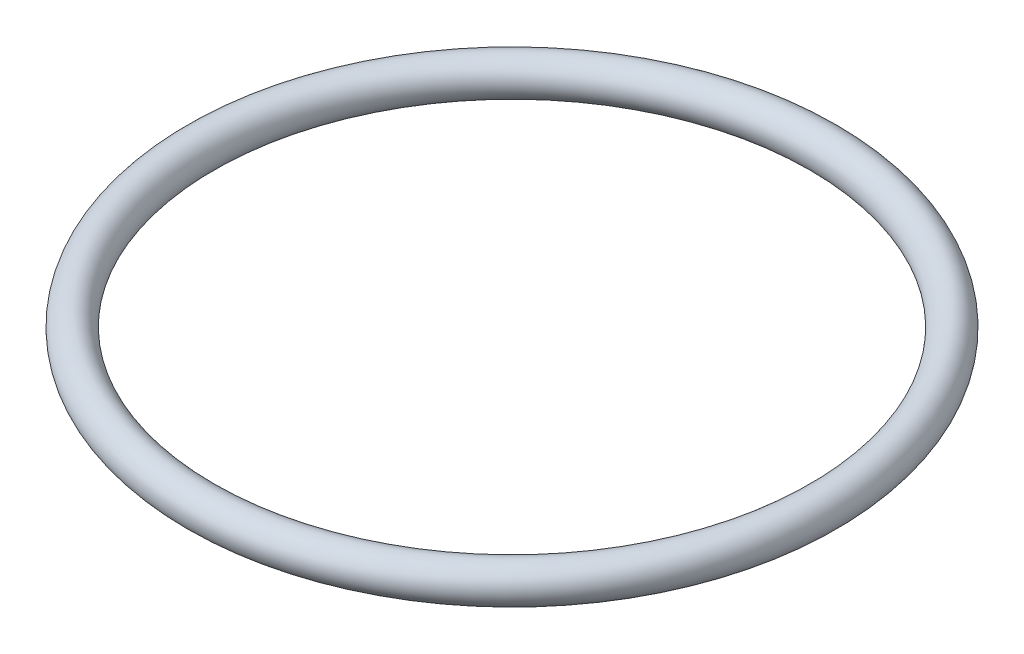
ISO-10303-21;
HEADER;
FILE_DESCRIPTION(('STEP AP214'),'2;1');
FILE_NAME('part.step','',(''),(''),'','','');
FILE_SCHEMA(('AUTOMOTIVE_DESIGN { 1 0 10303 214 1 1 1 1 }'));
ENDSEC;
DATA;
#1=APPLICATION_CONTEXT('core data for automotive mechanical design processes');
#2=APPLICATION_PROTOCOL_DEFINITION('international standard','automotive_design',2000,#1);
#3=PRODUCT_CONTEXT('',#1,'mechanical');
#4=PRODUCT('Part','Part','',(#3));
#5=PRODUCT_RELATED_PRODUCT_CATEGORY('part','',(#4));
#6=PRODUCT_DEFINITION_FORMATION('','',#4);
#7=PRODUCT_DEFINITION_CONTEXT('part definition',#1,'design');
#8=PRODUCT_DEFINITION('design','',#6,#7);
#9=PRODUCT_DEFINITION_SHAPE('','',#8);
#10=(LENGTH_UNIT() NAMED_UNIT(*) SI_UNIT(.MILLI.,.METRE.));
#11=(NAMED_UNIT(*) PLANE_ANGLE_UNIT() SI_UNIT($,.RADIAN.));
#12=(NAMED_UNIT(*) SI_UNIT($,.STERADIAN.) SOLID_ANGLE_UNIT());
#13=UNCERTAINTY_MEASURE_WITH_UNIT(LENGTH_MEASURE(1.E-05),#10,'distance_accuracy_value','');
#14=(GEOMETRIC_REPRESENTATION_CONTEXT(3) GLOBAL_UNCERTAINTY_ASSIGNED_CONTEXT((#13)) GLOBAL_UNIT_ASSIGNED_CONTEXT((#10,
#11,#12)) REPRESENTATION_CONTEXT('',''));
#15=CARTESIAN_POINT('',(0.,0.,0.));
#16=DIRECTION('',(0.,0.,1.));
#17=DIRECTION('',(1.,0.,0.));
#18=AXIS2_PLACEMENT_3D('',#15,#16,#17);
#19=CARTESIAN_POINT('',(0.,0.,0.));
#20=DIRECTION('',(0.,-1.,0.));
#21=DIRECTION('',(0.,0.,-1.));
#22=AXIS2_PLACEMENT_3D('',#19,#20,#21);
#23=TOROIDAL_SURFACE('',#22,43.5102,2.5908);
#24=CARTESIAN_POINT('',(0.,0.,-46.101));
#25=VERTEX_POINT('',#24);
#26=VERTEX_LOOP('',#25);
#27=FACE_BOUND('',#26,.T.);
#28=ADVANCED_FACE('F30',(#27),#23,.T.);
#29=CLOSED_SHELL('',(#28));
#30=MANIFOLD_SOLID_BREP('B2',#29);
#31=ADVANCED_BREP_SHAPE_REPRESENTATION('',(#18,#30),#14);
#32=SHAPE_DEFINITION_REPRESENTATION(#9,#31);
ENDSEC;
END-ISO-10303-21;
